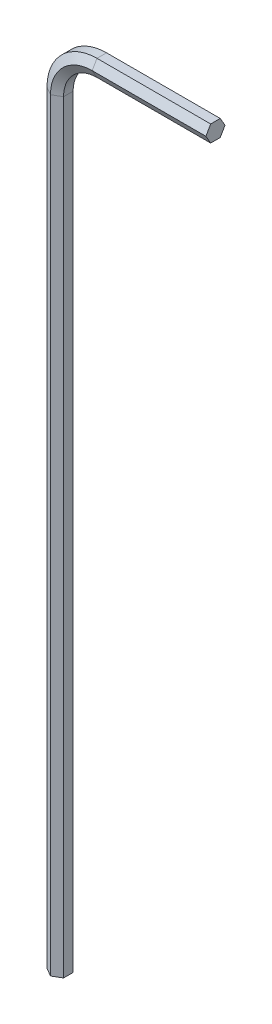
ISO-10303-21;
HEADER;
FILE_DESCRIPTION(('STEP AP214'),'2;1');
FILE_NAME('part.step','',(''),(''),'','','');
FILE_SCHEMA(('AUTOMOTIVE_DESIGN { 1 0 10303 214 1 1 1 1 }'));
ENDSEC;
DATA;
#1=APPLICATION_CONTEXT('core data for automotive mechanical design processes');
#2=APPLICATION_PROTOCOL_DEFINITION('international standard','automotive_design',2000,#1);
#3=PRODUCT_CONTEXT('',#1,'mechanical');
#4=PRODUCT('Part','Part','',(#3));
#5=PRODUCT_RELATED_PRODUCT_CATEGORY('part','',(#4));
#6=PRODUCT_DEFINITION_FORMATION('','',#4);
#7=PRODUCT_DEFINITION_CONTEXT('part definition',#1,'design');
#8=PRODUCT_DEFINITION('design','',#6,#7);
#9=PRODUCT_DEFINITION_SHAPE('','',#8);
#10=(LENGTH_UNIT() NAMED_UNIT(*) SI_UNIT(.MILLI.,.METRE.));
#11=(NAMED_UNIT(*) PLANE_ANGLE_UNIT() SI_UNIT($,.RADIAN.));
#12=(NAMED_UNIT(*) SI_UNIT($,.STERADIAN.) SOLID_ANGLE_UNIT());
#13=UNCERTAINTY_MEASURE_WITH_UNIT(LENGTH_MEASURE(1.E-05),#10,'distance_accuracy_value','');
#14=(GEOMETRIC_REPRESENTATION_CONTEXT(3) GLOBAL_UNCERTAINTY_ASSIGNED_CONTEXT((#13)) GLOBAL_UNIT_ASSIGNED_CONTEXT((#10,
#11,#12)) REPRESENTATION_CONTEXT('',''));
#15=CARTESIAN_POINT('',(0.,0.,0.));
#16=DIRECTION('',(0.,0.,1.));
#17=DIRECTION('',(1.,0.,0.));
#18=AXIS2_PLACEMENT_3D('',#15,#16,#17);
#19=CARTESIAN_POINT('',(4.00000000000003,77.20625,-0.91654355233853));
#20=DIRECTION('',(0.,0.500000000000001,-0.866025403784438));
#21=DIRECTION('',(0.,0.866025403784438,0.500000000000001));
#22=AXIS2_PLACEMENT_3D('',#19,#20,#21);
#23=PLANE('',#22);
#24=DIRECTION('',(0.,0.866025403784438,0.500000000000001));
#25=VECTOR('',#24,1.);
#26=CARTESIAN_POINT('',(4.00000000000003,77.20625,-0.91654355233853));
#27=LINE('',#26,#25);
#28=CARTESIAN_POINT('',(4.00000000000003,77.20625,-0.91654355233853));
#29=VERTEX_POINT('',#28);
#30=CARTESIAN_POINT('',(4.00000000000005,78.,-0.458271776169263));
#31=VERTEX_POINT('',#30);
#32=EDGE_CURVE('E143',#29,#31,#27,.T.);
#33=ORIENTED_EDGE('',*,*,#32,.T.);
#34=DIRECTION('',(1.,0.,0.));
#35=VECTOR('',#34,1.);
#36=CARTESIAN_POINT('',(4.00000000000005,78.,-0.458271776169263));
#37=LINE('',#36,#35);
#38=CARTESIAN_POINT('',(14.90625,78.,-0.458271776169263));
#39=VERTEX_POINT('',#38);
#40=EDGE_CURVE('E23',#31,#39,#37,.T.);
#41=ORIENTED_EDGE('',*,*,#40,.T.);
#42=DIRECTION('',(0.,0.866025403784438,0.500000000000001));
#43=VECTOR('',#42,1.);
#44=CARTESIAN_POINT('',(14.90625,77.20625,-0.91654355233853));
#45=LINE('',#44,#43);
#46=CARTESIAN_POINT('',(14.90625,77.20625,-0.91654355233853));
#47=VERTEX_POINT('',#46);
#48=EDGE_CURVE('E35',#47,#39,#45,.T.);
#49=ORIENTED_EDGE('',*,*,#48,.F.);
#50=DIRECTION('',(1.,0.,0.));
#51=VECTOR('',#50,1.);
#52=CARTESIAN_POINT('',(4.00000000000003,77.20625,-0.91654355233853));
#53=LINE('',#52,#51);
#54=EDGE_CURVE('E10',#29,#47,#53,.T.);
#55=ORIENTED_EDGE('',*,*,#54,.F.);
#56=EDGE_LOOP('',(#33,#41,#49,#55));
#57=FACE_BOUND('',#56,.T.);
#58=ADVANCED_FACE('F15',(#57),#23,.T.);
#59=CARTESIAN_POINT('',(4.00000000000005,78.,-0.458271776169263));
#60=DIRECTION('',(0.,1.,0.));
#61=DIRECTION('',(0.,0.,1.));
#62=AXIS2_PLACEMENT_3D('',#59,#60,#61);
#63=PLANE('',#62);
#64=DIRECTION('',(0.,0.,1.));
#65=VECTOR('',#64,1.);
#66=CARTESIAN_POINT('',(4.00000000000005,78.,-0.458271776169263));
#67=LINE('',#66,#65);
#68=CARTESIAN_POINT('',(4.00000000000005,78.,0.458271776169269));
#69=VERTEX_POINT('',#68);
#70=EDGE_CURVE('E201',#31,#69,#67,.T.);
#71=ORIENTED_EDGE('',*,*,#70,.T.);
#72=DIRECTION('',(1.,0.,0.));
#73=VECTOR('',#72,1.);
#74=CARTESIAN_POINT('',(4.00000000000005,78.,0.458271776169269));
#75=LINE('',#74,#73);
#76=CARTESIAN_POINT('',(14.90625,78.,0.458271776169269));
#77=VERTEX_POINT('',#76);
#78=EDGE_CURVE('E253',#69,#77,#75,.T.);
#79=ORIENTED_EDGE('',*,*,#78,.T.);
#80=DIRECTION('',(0.,0.,1.));
#81=VECTOR('',#80,1.);
#82=CARTESIAN_POINT('',(14.90625,78.,-0.458271776169263));
#83=LINE('',#82,#81);
#84=EDGE_CURVE('E45',#39,#77,#83,.T.);
#85=ORIENTED_EDGE('',*,*,#84,.F.);
#86=ORIENTED_EDGE('',*,*,#40,.F.);
#87=EDGE_LOOP('',(#71,#79,#85,#86));
#88=FACE_BOUND('',#87,.T.);
#89=ADVANCED_FACE('F258',(#88),#63,.T.);
#90=CARTESIAN_POINT('',(4.00000000000005,78.,0.458271776169269));
#91=DIRECTION('',(0.,0.499999999999995,0.866025403784442));
#92=DIRECTION('',(0.,-0.866025403784442,0.499999999999995));
#93=AXIS2_PLACEMENT_3D('',#90,#91,#92);
#94=PLANE('',#93);
#95=DIRECTION('',(0.,-0.866025403784442,0.499999999999995));
#96=VECTOR('',#95,1.);
#97=CARTESIAN_POINT('',(4.00000000000005,78.,0.458271776169269));
#98=LINE('',#97,#96);
#99=CARTESIAN_POINT('',(4.00000000000003,77.20625,0.91654355233853));
#100=VERTEX_POINT('',#99);
#101=EDGE_CURVE('E197',#69,#100,#98,.T.);
#102=ORIENTED_EDGE('',*,*,#101,.T.);
#103=DIRECTION('',(1.,0.,0.));
#104=VECTOR('',#103,1.);
#105=CARTESIAN_POINT('',(4.00000000000003,77.20625,0.91654355233853));
#106=LINE('',#105,#104);
#107=CARTESIAN_POINT('',(14.90625,77.20625,0.91654355233853));
#108=VERTEX_POINT('',#107);
#109=EDGE_CURVE('E249',#100,#108,#106,.T.);
#110=ORIENTED_EDGE('',*,*,#109,.T.);
#111=DIRECTION('',(0.,-0.866025403784442,0.499999999999995));
#112=VECTOR('',#111,1.);
#113=CARTESIAN_POINT('',(14.90625,78.,0.458271776169269));
#114=LINE('',#113,#112);
#115=EDGE_CURVE('E233',#77,#108,#114,.T.);
#116=ORIENTED_EDGE('',*,*,#115,.F.);
#117=ORIENTED_EDGE('',*,*,#78,.F.);
#118=EDGE_LOOP('',(#102,#110,#116,#117));
#119=FACE_BOUND('',#118,.T.);
#120=ADVANCED_FACE('F339',(#119),#94,.T.);
#121=CARTESIAN_POINT('',(4.00000000000003,77.20625,0.91654355233853));
#122=DIRECTION('',(0.,-0.500000000000007,0.866025403784435));
#123=DIRECTION('',(0.,-0.866025403784435,-0.500000000000007));
#124=AXIS2_PLACEMENT_3D('',#121,#122,#123);
#125=PLANE('',#124);
#126=DIRECTION('',(0.,-0.866025403784435,-0.500000000000007));
#127=VECTOR('',#126,1.);
#128=CARTESIAN_POINT('',(4.00000000000003,77.20625,0.91654355233853));
#129=LINE('',#128,#127);
#130=CARTESIAN_POINT('',(4.00000000000002,76.4125,0.458271776169257));
#131=VERTEX_POINT('',#130);
#132=EDGE_CURVE('E193',#100,#131,#129,.T.);
#133=ORIENTED_EDGE('',*,*,#132,.T.);
#134=DIRECTION('',(1.,0.,0.));
#135=VECTOR('',#134,1.);
#136=CARTESIAN_POINT('',(4.00000000000002,76.4125,0.458271776169257));
#137=LINE('',#136,#135);
#138=CARTESIAN_POINT('',(14.90625,76.4125,0.458271776169257));
#139=VERTEX_POINT('',#138);
#140=EDGE_CURVE('E245',#131,#139,#137,.T.);
#141=ORIENTED_EDGE('',*,*,#140,.T.);
#142=DIRECTION('',(0.,-0.866025403784435,-0.500000000000007));
#143=VECTOR('',#142,1.);
#144=CARTESIAN_POINT('',(14.90625,77.20625,0.91654355233853));
#145=LINE('',#144,#143);
#146=EDGE_CURVE('E229',#108,#139,#145,.T.);
#147=ORIENTED_EDGE('',*,*,#146,.F.);
#148=ORIENTED_EDGE('',*,*,#109,.F.);
#149=EDGE_LOOP('',(#133,#141,#147,#148));
#150=FACE_BOUND('',#149,.T.);
#151=ADVANCED_FACE('F338',(#150),#125,.T.);
#152=CARTESIAN_POINT('',(4.00000000000002,76.4125,0.458271776169257));
#153=DIRECTION('',(0.,-1.,0.));
#154=DIRECTION('',(0.,0.,-1.));
#155=AXIS2_PLACEMENT_3D('',#152,#153,#154);
#156=PLANE('',#155);
#157=DIRECTION('',(0.,0.,-1.));
#158=VECTOR('',#157,1.);
#159=CARTESIAN_POINT('',(4.00000000000002,76.4125,0.458271776169257));
#160=LINE('',#159,#158);
#161=CARTESIAN_POINT('',(4.00000000000002,76.4125,-0.458271776169274));
#162=VERTEX_POINT('',#161);
#163=EDGE_CURVE('E184',#131,#162,#160,.T.);
#164=ORIENTED_EDGE('',*,*,#163,.T.);
#165=DIRECTION('',(1.,0.,0.));
#166=VECTOR('',#165,1.);
#167=CARTESIAN_POINT('',(4.00000000000002,76.4125,-0.458271776169274));
#168=LINE('',#167,#166);
#169=CARTESIAN_POINT('',(14.90625,76.4125,-0.458271776169274));
#170=VERTEX_POINT('',#169);
#171=EDGE_CURVE('E241',#162,#170,#168,.T.);
#172=ORIENTED_EDGE('',*,*,#171,.T.);
#173=DIRECTION('',(0.,0.,-1.));
#174=VECTOR('',#173,1.);
#175=CARTESIAN_POINT('',(14.90625,76.4125,0.458271776169257));
#176=LINE('',#175,#174);
#177=EDGE_CURVE('E225',#139,#170,#176,.T.);
#178=ORIENTED_EDGE('',*,*,#177,.F.);
#179=ORIENTED_EDGE('',*,*,#140,.F.);
#180=EDGE_LOOP('',(#164,#172,#178,#179));
#181=FACE_BOUND('',#180,.T.);
#182=ADVANCED_FACE('F345',(#181),#156,.T.);
#183=CARTESIAN_POINT('',(4.00000000000002,76.4125,-0.458271776169274));
#184=DIRECTION('',(0.,-0.499999999999995,-0.866025403784442));
#185=DIRECTION('',(0.,0.866025403784442,-0.499999999999995));
#186=AXIS2_PLACEMENT_3D('',#183,#184,#185);
#187=PLANE('',#186);
#188=DIRECTION('',(0.,0.866025403784442,-0.499999999999995));
#189=VECTOR('',#188,1.);
#190=CARTESIAN_POINT('',(4.00000000000002,76.4125,-0.458271776169274));
#191=LINE('',#190,#189);
#192=EDGE_CURVE('E177',#162,#29,#191,.T.);
#193=ORIENTED_EDGE('',*,*,#192,.T.);
#194=ORIENTED_EDGE('',*,*,#54,.T.);
#195=DIRECTION('',(0.,0.866025403784442,-0.499999999999995));
#196=VECTOR('',#195,1.);
#197=CARTESIAN_POINT('',(14.90625,76.4125,-0.458271776169274));
#198=LINE('',#197,#196);
#199=EDGE_CURVE('E147',#170,#47,#198,.T.);
#200=ORIENTED_EDGE('',*,*,#199,.F.);
#201=ORIENTED_EDGE('',*,*,#171,.F.);
#202=EDGE_LOOP('',(#193,#194,#200,#201));
#203=FACE_BOUND('',#202,.T.);
#204=ADVANCED_FACE('F343',(#203),#187,.T.);
#205=CARTESIAN_POINT('',(4.,73.20625,-0.91654355233853));
#206=DIRECTION('',(0.,0.,1.));
#207=DIRECTION('',(1.,0.,0.));
#208=AXIS2_PLACEMENT_3D('',#205,#206,#207);
#209=CONICAL_SURFACE('',#208,4.,1.0471975511966);
#210=DIRECTION('',(-0.866025403784438,0.,0.500000000000001));
#211=VECTOR('',#210,1.);
#212=CARTESIAN_POINT('',(0.,73.20625,-0.91654355233853));
#213=LINE('',#212,#211);
#214=CARTESIAN_POINT('',(0.,73.20625,-0.91654355233853));
#215=VERTEX_POINT('',#214);
#216=CARTESIAN_POINT('',(-0.79375,73.20625,-0.458271776169263));
#217=VERTEX_POINT('',#216);
#218=EDGE_CURVE('E140',#215,#217,#213,.T.);
#219=ORIENTED_EDGE('',*,*,#218,.T.);
#220=CARTESIAN_POINT('',(4.,73.20625,-0.458271776169263));
#221=DIRECTION('',(0.,0.,-1.));
#222=DIRECTION('',(-1.,0.,0.));
#223=AXIS2_PLACEMENT_3D('',#220,#221,#222);
#224=CIRCLE('',#223,4.79375);
#225=EDGE_CURVE('E148',#217,#31,#224,.T.);
#226=ORIENTED_EDGE('',*,*,#225,.T.);
#227=ORIENTED_EDGE('',*,*,#32,.F.);
#228=CARTESIAN_POINT('',(4.,73.20625,-0.91654355233853));
#229=DIRECTION('',(0.,0.,-1.));
#230=DIRECTION('',(-1.,0.,0.));
#231=AXIS2_PLACEMENT_3D('',#228,#229,#230);
#232=CIRCLE('',#231,4.);
#233=EDGE_CURVE('E135',#215,#29,#232,.T.);
#234=ORIENTED_EDGE('',*,*,#233,.F.);
#235=EDGE_LOOP('',(#219,#226,#227,#234));
#236=FACE_BOUND('',#235,.T.);
#237=ADVANCED_FACE('F137',(#236),#209,.T.);
#238=CARTESIAN_POINT('',(4.,73.20625,0.));
#239=DIRECTION('',(0.,0.,-1.));
#240=DIRECTION('',(-1.,0.,0.));
#241=AXIS2_PLACEMENT_3D('',#238,#239,#240);
#242=CYLINDRICAL_SURFACE('',#241,4.79375);
#243=DIRECTION('',(0.,0.,1.));
#244=VECTOR('',#243,1.);
#245=CARTESIAN_POINT('',(-0.79375,73.20625,-0.458271776169263));
#246=LINE('',#245,#244);
#247=CARTESIAN_POINT('',(-0.793749999999997,73.20625,0.458271776169269));
#248=VERTEX_POINT('',#247);
#249=EDGE_CURVE('E171',#217,#248,#246,.T.);
#250=ORIENTED_EDGE('',*,*,#249,.T.);
#251=CARTESIAN_POINT('',(4.,73.20625,0.458271776169269));
#252=DIRECTION('',(0.,0.,-1.));
#253=DIRECTION('',(-1.,0.,0.));
#254=AXIS2_PLACEMENT_3D('',#251,#252,#253);
#255=CIRCLE('',#254,4.79375);
#256=EDGE_CURVE('E217',#248,#69,#255,.T.);
#257=ORIENTED_EDGE('',*,*,#256,.T.);
#258=ORIENTED_EDGE('',*,*,#70,.F.);
#259=ORIENTED_EDGE('',*,*,#225,.F.);
#260=EDGE_LOOP('',(#250,#257,#258,#259));
#261=FACE_BOUND('',#260,.T.);
#262=ADVANCED_FACE('F267',(#261),#242,.T.);
#263=CARTESIAN_POINT('',(4.,73.20625,0.458271776169269));
#264=DIRECTION('',(0.,0.,-1.));
#265=DIRECTION('',(-1.,0.,0.));
#266=AXIS2_PLACEMENT_3D('',#263,#264,#265);
#267=CONICAL_SURFACE('',#266,4.79375,1.0471975511966);
#268=DIRECTION('',(0.866025403784442,0.,0.499999999999995));
#269=VECTOR('',#268,1.);
#270=CARTESIAN_POINT('',(-0.793749999999997,73.20625,0.458271776169269));
#271=LINE('',#270,#269);
#272=CARTESIAN_POINT('',(0.,73.20625,0.91654355233853));
#273=VERTEX_POINT('',#272);
#274=EDGE_CURVE('E271',#248,#273,#271,.T.);
#275=ORIENTED_EDGE('',*,*,#274,.T.);
#276=CARTESIAN_POINT('',(4.,73.20625,0.91654355233853));
#277=DIRECTION('',(0.,0.,-1.));
#278=DIRECTION('',(-1.,0.,0.));
#279=AXIS2_PLACEMENT_3D('',#276,#277,#278);
#280=CIRCLE('',#279,3.99999999999999);
#281=EDGE_CURVE('E213',#273,#100,#280,.T.);
#282=ORIENTED_EDGE('',*,*,#281,.T.);
#283=ORIENTED_EDGE('',*,*,#101,.F.);
#284=ORIENTED_EDGE('',*,*,#256,.F.);
#285=EDGE_LOOP('',(#275,#282,#283,#284));
#286=FACE_BOUND('',#285,.T.);
#287=ADVANCED_FACE('F263',(#286),#267,.T.);
#288=CARTESIAN_POINT('',(4.,73.20625,0.91654355233853));
#289=DIRECTION('',(0.,0.,1.));
#290=DIRECTION('',(1.,0.,0.));
#291=AXIS2_PLACEMENT_3D('',#288,#289,#290);
#292=CONICAL_SURFACE('',#291,3.99999999999999,1.04719755119659);
#293=DIRECTION('',(0.866025403784435,0.,-0.500000000000007));
#294=VECTOR('',#293,1.);
#295=CARTESIAN_POINT('',(0.,73.20625,0.91654355233853));
#296=LINE('',#295,#294);
#297=CARTESIAN_POINT('',(0.793750000000003,73.20625,0.458271776169257));
#298=VERTEX_POINT('',#297);
#299=EDGE_CURVE('E287',#273,#298,#296,.T.);
#300=ORIENTED_EDGE('',*,*,#299,.T.);
#301=CARTESIAN_POINT('',(4.,73.20625,0.458271776169257));
#302=DIRECTION('',(0.,0.,-1.));
#303=DIRECTION('',(-1.,0.,0.));
#304=AXIS2_PLACEMENT_3D('',#301,#302,#303);
#305=CIRCLE('',#304,3.20625);
#306=EDGE_CURVE('E209',#298,#131,#305,.T.);
#307=ORIENTED_EDGE('',*,*,#306,.T.);
#308=ORIENTED_EDGE('',*,*,#132,.F.);
#309=ORIENTED_EDGE('',*,*,#281,.F.);
#310=EDGE_LOOP('',(#300,#307,#308,#309));
#311=FACE_BOUND('',#310,.T.);
#312=ADVANCED_FACE('F336',(#311),#292,.F.);
#313=CARTESIAN_POINT('',(4.,73.20625,0.));
#314=DIRECTION('',(0.,0.,-1.));
#315=DIRECTION('',(-1.,0.,0.));
#316=AXIS2_PLACEMENT_3D('',#313,#314,#315);
#317=CYLINDRICAL_SURFACE('',#316,3.20625);
#318=DIRECTION('',(0.,0.,-1.));
#319=VECTOR('',#318,1.);
#320=CARTESIAN_POINT('',(0.793750000000003,73.20625,0.458271776169257));
#321=LINE('',#320,#319);
#322=CARTESIAN_POINT('',(0.793749999999994,73.20625,-0.458271776169274));
#323=VERTEX_POINT('',#322);
#324=EDGE_CURVE('E292',#298,#323,#321,.T.);
#325=ORIENTED_EDGE('',*,*,#324,.T.);
#326=CARTESIAN_POINT('',(4.,73.20625,-0.458271776169274));
#327=DIRECTION('',(0.,0.,-1.));
#328=DIRECTION('',(-1.,0.,0.));
#329=AXIS2_PLACEMENT_3D('',#326,#327,#328);
#330=CIRCLE('',#329,3.20625000000001);
#331=EDGE_CURVE('E154',#323,#162,#330,.T.);
#332=ORIENTED_EDGE('',*,*,#331,.T.);
#333=ORIENTED_EDGE('',*,*,#163,.F.);
#334=ORIENTED_EDGE('',*,*,#306,.F.);
#335=EDGE_LOOP('',(#325,#332,#333,#334));
#336=FACE_BOUND('',#335,.T.);
#337=ADVANCED_FACE('F333',(#336),#317,.F.);
#338=CARTESIAN_POINT('',(4.,73.20625,-0.458271776169274));
#339=DIRECTION('',(0.,0.,-1.));
#340=DIRECTION('',(-1.,0.,0.));
#341=AXIS2_PLACEMENT_3D('',#338,#339,#340);
#342=CONICAL_SURFACE('',#341,3.20625000000001,1.0471975511966);
#343=DIRECTION('',(-0.866025403784442,0.,-0.499999999999995));
#344=VECTOR('',#343,1.);
#345=CARTESIAN_POINT('',(0.793749999999994,73.20625,-0.458271776169274));
#346=LINE('',#345,#344);
#347=EDGE_CURVE('E151',#323,#215,#346,.T.);
#348=ORIENTED_EDGE('',*,*,#347,.T.);
#349=ORIENTED_EDGE('',*,*,#233,.T.);
#350=ORIENTED_EDGE('',*,*,#192,.F.);
#351=ORIENTED_EDGE('',*,*,#331,.F.);
#352=EDGE_LOOP('',(#348,#349,#350,#351));
#353=FACE_BOUND('',#352,.T.);
#354=ADVANCED_FACE('F152',(#353),#342,.F.);
#355=CARTESIAN_POINT('',(0.793749999999994,73.20625,-0.458271776169274));
#356=DIRECTION('',(-0.499999999999995,0.,0.866025403784441));
#357=DIRECTION('',(0.866025403784442,0.,0.499999999999995));
#358=AXIS2_PLACEMENT_3D('',#355,#356,#357);
#359=PLANE('',#358);
#360=DIRECTION('',(-0.866025403784442,0.,-0.499999999999995));
#361=VECTOR('',#360,1.);
#362=CARTESIAN_POINT('',(0.793749999999994,0.,-0.458271776169274));
#363=LINE('',#362,#361);
#364=CARTESIAN_POINT('',(0.793749999999994,0.,-0.458271776169274));
#365=VERTEX_POINT('',#364);
#366=CARTESIAN_POINT('',(0.,0.,-0.91654355233853));
#367=VERTEX_POINT('',#366);
#368=EDGE_CURVE('E175',#365,#367,#363,.T.);
#369=ORIENTED_EDGE('',*,*,#368,.T.);
#370=DIRECTION('',(0.,-1.,0.));
#371=VECTOR('',#370,1.);
#372=CARTESIAN_POINT('',(0.,73.20625,-0.91654355233853));
#373=LINE('',#372,#371);
#374=EDGE_CURVE('E165',#215,#367,#373,.T.);
#375=ORIENTED_EDGE('',*,*,#374,.F.);
#376=ORIENTED_EDGE('',*,*,#347,.F.);
#377=DIRECTION('',(0.,-1.,0.));
#378=VECTOR('',#377,1.);
#379=CARTESIAN_POINT('',(0.793749999999994,73.20625,-0.458271776169274));
#380=LINE('',#379,#378);
#381=EDGE_CURVE('E297',#323,#365,#380,.T.);
#382=ORIENTED_EDGE('',*,*,#381,.T.);
#383=EDGE_LOOP('',(#369,#375,#376,#382));
#384=FACE_BOUND('',#383,.T.);
#385=ADVANCED_FACE('F173',(#384),#359,.F.);
#386=CARTESIAN_POINT('',(0.,73.20625,-0.91654355233853));
#387=DIRECTION('',(0.500000000000001,0.,0.866025403784438));
#388=DIRECTION('',(0.866025403784438,0.,-0.500000000000001));
#389=AXIS2_PLACEMENT_3D('',#386,#387,#388);
#390=PLANE('',#389);
#391=DIRECTION('',(-0.866025403784438,0.,0.500000000000001));
#392=VECTOR('',#391,1.);
#393=CARTESIAN_POINT('',(0.,0.,-0.91654355233853));
#394=LINE('',#393,#392);
#395=CARTESIAN_POINT('',(-0.79375,0.,-0.458271776169263));
#396=VERTEX_POINT('',#395);
#397=EDGE_CURVE('E300',#367,#396,#394,.T.);
#398=ORIENTED_EDGE('',*,*,#397,.T.);
#399=DIRECTION('',(0.,-1.,0.));
#400=VECTOR('',#399,1.);
#401=CARTESIAN_POINT('',(-0.79375,73.20625,-0.458271776169263));
#402=LINE('',#401,#400);
#403=EDGE_CURVE('E168',#217,#396,#402,.T.);
#404=ORIENTED_EDGE('',*,*,#403,.F.);
#405=ORIENTED_EDGE('',*,*,#218,.F.);
#406=ORIENTED_EDGE('',*,*,#374,.T.);
#407=EDGE_LOOP('',(#398,#404,#405,#406));
#408=FACE_BOUND('',#407,.T.);
#409=ADVANCED_FACE('F164',(#408),#390,.F.);
#410=CARTESIAN_POINT('',(-0.79375,73.20625,-0.458271776169263));
#411=DIRECTION('',(1.,0.,0.));
#412=DIRECTION('',(0.,0.,-1.));
#413=AXIS2_PLACEMENT_3D('',#410,#411,#412);
#414=PLANE('',#413);
#415=DIRECTION('',(0.,0.,1.));
#416=VECTOR('',#415,1.);
#417=CARTESIAN_POINT('',(-0.79375,0.,-0.458271776169263));
#418=LINE('',#417,#416);
#419=CARTESIAN_POINT('',(-0.793749999999997,0.,0.458271776169269));
#420=VERTEX_POINT('',#419);
#421=EDGE_CURVE('E277',#396,#420,#418,.T.);
#422=ORIENTED_EDGE('',*,*,#421,.T.);
#423=DIRECTION('',(0.,-1.,0.));
#424=VECTOR('',#423,1.);
#425=CARTESIAN_POINT('',(-0.793749999999997,73.20625,0.458271776169269));
#426=LINE('',#425,#424);
#427=EDGE_CURVE('E186',#248,#420,#426,.T.);
#428=ORIENTED_EDGE('',*,*,#427,.F.);
#429=ORIENTED_EDGE('',*,*,#249,.F.);
#430=ORIENTED_EDGE('',*,*,#403,.T.);
#431=EDGE_LOOP('',(#422,#428,#429,#430));
#432=FACE_BOUND('',#431,.T.);
#433=ADVANCED_FACE('F275',(#432),#414,.F.);
#434=CARTESIAN_POINT('',(-0.793749999999997,73.20625,0.458271776169269));
#435=DIRECTION('',(0.499999999999995,0.,-0.866025403784442));
#436=DIRECTION('',(-0.866025403784442,0.,-0.499999999999995));
#437=AXIS2_PLACEMENT_3D('',#434,#435,#436);
#438=PLANE('',#437);
#439=DIRECTION('',(0.866025403784442,0.,0.499999999999995));
#440=VECTOR('',#439,1.);
#441=CARTESIAN_POINT('',(-0.793749999999997,0.,0.458271776169269));
#442=LINE('',#441,#440);
#443=CARTESIAN_POINT('',(0.,0.,0.91654355233853));
#444=VERTEX_POINT('',#443);
#445=EDGE_CURVE('E305',#420,#444,#442,.T.);
#446=ORIENTED_EDGE('',*,*,#445,.T.);
#447=DIRECTION('',(0.,-1.,0.));
#448=VECTOR('',#447,1.);
#449=CARTESIAN_POINT('',(0.,73.20625,0.91654355233853));
#450=LINE('',#449,#448);
#451=EDGE_CURVE('E281',#273,#444,#450,.T.);
#452=ORIENTED_EDGE('',*,*,#451,.F.);
#453=ORIENTED_EDGE('',*,*,#274,.F.);
#454=ORIENTED_EDGE('',*,*,#427,.T.);
#455=EDGE_LOOP('',(#446,#452,#453,#454));
#456=FACE_BOUND('',#455,.T.);
#457=ADVANCED_FACE('F283',(#456),#438,.F.);
#458=CARTESIAN_POINT('',(0.,73.20625,0.91654355233853));
#459=DIRECTION('',(-0.500000000000007,0.,-0.866025403784435));
#460=DIRECTION('',(-0.866025403784435,0.,0.500000000000007));
#461=AXIS2_PLACEMENT_3D('',#458,#459,#460);
#462=PLANE('',#461);
#463=DIRECTION('',(0.866025403784435,0.,-0.500000000000007));
#464=VECTOR('',#463,1.);
#465=CARTESIAN_POINT('',(0.,0.,0.91654355233853));
#466=LINE('',#465,#464);
#467=CARTESIAN_POINT('',(0.793750000000003,0.,0.458271776169257));
#468=VERTEX_POINT('',#467);
#469=EDGE_CURVE('E308',#444,#468,#466,.T.);
#470=ORIENTED_EDGE('',*,*,#469,.T.);
#471=DIRECTION('',(0.,-1.,0.));
#472=VECTOR('',#471,1.);
#473=CARTESIAN_POINT('',(0.793750000000003,73.20625,0.458271776169257));
#474=LINE('',#473,#472);
#475=EDGE_CURVE('E315',#298,#468,#474,.T.);
#476=ORIENTED_EDGE('',*,*,#475,.F.);
#477=ORIENTED_EDGE('',*,*,#299,.F.);
#478=ORIENTED_EDGE('',*,*,#451,.T.);
#479=EDGE_LOOP('',(#470,#476,#477,#478));
#480=FACE_BOUND('',#479,.T.);
#481=ADVANCED_FACE('F323',(#480),#462,.F.);
#482=CARTESIAN_POINT('',(0.793750000000003,73.20625,0.458271776169257));
#483=DIRECTION('',(-1.,0.,0.));
#484=DIRECTION('',(0.,0.,1.));
#485=AXIS2_PLACEMENT_3D('',#482,#483,#484);
#486=PLANE('',#485);
#487=DIRECTION('',(0.,0.,-1.));
#488=VECTOR('',#487,1.);
#489=CARTESIAN_POINT('',(0.793750000000003,0.,0.458271776169257));
#490=LINE('',#489,#488);
#491=EDGE_CURVE('E160',#468,#365,#490,.T.);
#492=ORIENTED_EDGE('',*,*,#491,.T.);
#493=ORIENTED_EDGE('',*,*,#381,.F.);
#494=ORIENTED_EDGE('',*,*,#324,.F.);
#495=ORIENTED_EDGE('',*,*,#475,.T.);
#496=EDGE_LOOP('',(#492,#493,#494,#495));
#497=FACE_BOUND('',#496,.T.);
#498=ADVANCED_FACE('F330',(#497),#486,.F.);
#499=CARTESIAN_POINT('',(14.90625,77.20625,0.));
#500=DIRECTION('',(1.,0.,0.));
#501=DIRECTION('',(0.,0.,1.));
#502=AXIS2_PLACEMENT_3D('',#499,#500,#501);
#503=PLANE('',#502);
#504=ORIENTED_EDGE('',*,*,#199,.T.);
#505=ORIENTED_EDGE('',*,*,#48,.T.);
#506=ORIENTED_EDGE('',*,*,#84,.T.);
#507=ORIENTED_EDGE('',*,*,#115,.T.);
#508=ORIENTED_EDGE('',*,*,#146,.T.);
#509=ORIENTED_EDGE('',*,*,#177,.T.);
#510=EDGE_LOOP('',(#504,#505,#506,#507,#508,#509));
#511=FACE_BOUND('',#510,.T.);
#512=ADVANCED_FACE('F341',(#511),#503,.T.);
#513=CARTESIAN_POINT('',(0.,0.,0.));
#514=DIRECTION('',(0.,1.,0.));
#515=DIRECTION('',(0.,0.,1.));
#516=AXIS2_PLACEMENT_3D('',#513,#514,#515);
#517=PLANE('',#516);
#518=ORIENTED_EDGE('',*,*,#368,.F.);
#519=ORIENTED_EDGE('',*,*,#491,.F.);
#520=ORIENTED_EDGE('',*,*,#469,.F.);
#521=ORIENTED_EDGE('',*,*,#445,.F.);
#522=ORIENTED_EDGE('',*,*,#421,.F.);
#523=ORIENTED_EDGE('',*,*,#397,.F.);
#524=EDGE_LOOP('',(#518,#519,#520,#521,#522,#523));
#525=FACE_BOUND('',#524,.T.);
#526=ADVANCED_FACE('F327',(#525),#517,.F.);
#527=CLOSED_SHELL('',(#58,#89,#120,#151,#182,#204,#237,#262,#287,#312,#337,#354,#385,#409,#433,
#457,#481,#498,#512,#526));
#528=MANIFOLD_SOLID_BREP('B1',#527);
#529=ADVANCED_BREP_SHAPE_REPRESENTATION('',(#18,#528),#14);
#530=SHAPE_DEFINITION_REPRESENTATION(#9,#529);
ENDSEC;
END-ISO-10303-21;
